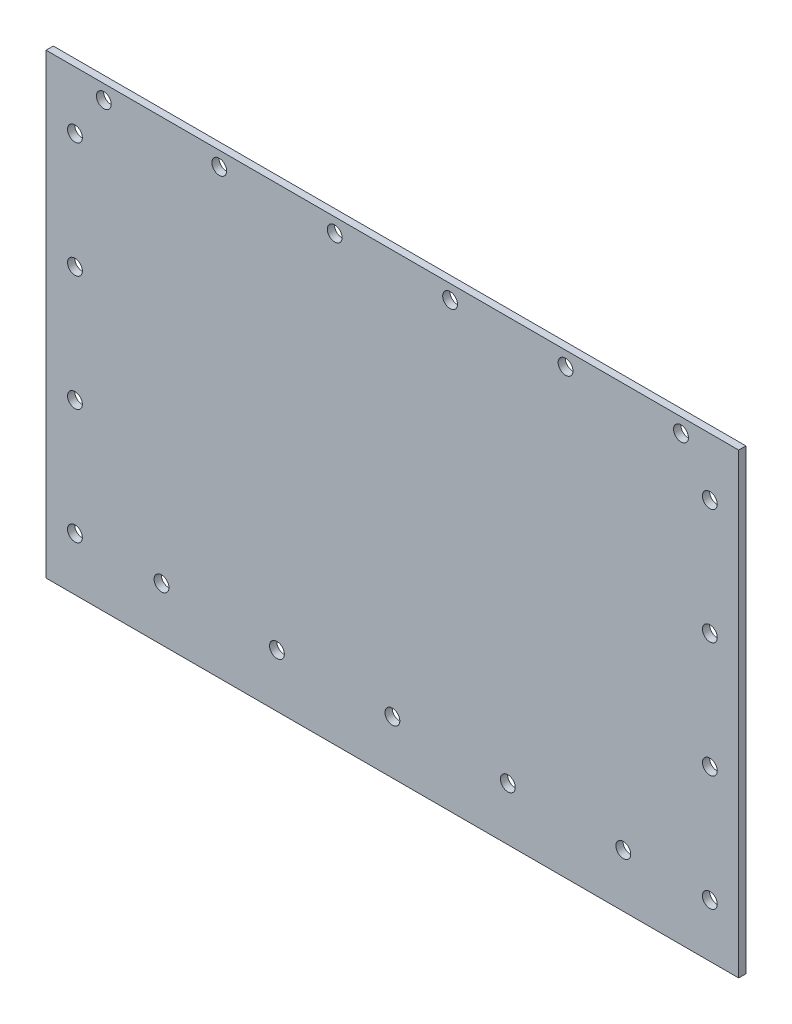
ISO-10303-21;
HEADER;
FILE_DESCRIPTION(('STEP AP214'),'2;1');
FILE_NAME('part.step','',(''),(''),'','','');
FILE_SCHEMA(('AUTOMOTIVE_DESIGN { 1 0 10303 214 1 1 1 1 }'));
ENDSEC;
DATA;
#1=APPLICATION_CONTEXT('core data for automotive mechanical design processes');
#2=APPLICATION_PROTOCOL_DEFINITION('international standard','automotive_design',2000,#1);
#3=PRODUCT_CONTEXT('',#1,'mechanical');
#4=PRODUCT('Part','Part','',(#3));
#5=PRODUCT_RELATED_PRODUCT_CATEGORY('part','',(#4));
#6=PRODUCT_DEFINITION_FORMATION('','',#4);
#7=PRODUCT_DEFINITION_CONTEXT('part definition',#1,'design');
#8=PRODUCT_DEFINITION('design','',#6,#7);
#9=PRODUCT_DEFINITION_SHAPE('','',#8);
#10=(LENGTH_UNIT() NAMED_UNIT(*) SI_UNIT(.MILLI.,.METRE.));
#11=(NAMED_UNIT(*) PLANE_ANGLE_UNIT() SI_UNIT($,.RADIAN.));
#12=(NAMED_UNIT(*) SI_UNIT($,.STERADIAN.) SOLID_ANGLE_UNIT());
#13=UNCERTAINTY_MEASURE_WITH_UNIT(LENGTH_MEASURE(1.E-05),#10,'distance_accuracy_value','');
#14=(GEOMETRIC_REPRESENTATION_CONTEXT(3) GLOBAL_UNCERTAINTY_ASSIGNED_CONTEXT((#13)) GLOBAL_UNIT_ASSIGNED_CONTEXT((#10,
#11,#12)) REPRESENTATION_CONTEXT('',''));
#15=CARTESIAN_POINT('',(0.,0.,0.));
#16=DIRECTION('',(0.,0.,1.));
#17=DIRECTION('',(1.,0.,0.));
#18=AXIS2_PLACEMENT_3D('',#15,#16,#17);
#19=CARTESIAN_POINT('',(152.4,0.,1.5875));
#20=DIRECTION('',(1.,0.,0.));
#21=DIRECTION('',(0.,0.,-1.));
#22=AXIS2_PLACEMENT_3D('',#19,#20,#21);
#23=PLANE('',#22);
#24=DIRECTION('',(0.,-1.,0.));
#25=VECTOR('',#24,1.);
#26=CARTESIAN_POINT('',(152.4,0.,0.));
#27=LINE('',#26,#25);
#28=CARTESIAN_POINT('',(152.4,0.,0.));
#29=VERTEX_POINT('',#28);
#30=CARTESIAN_POINT('',(152.4,-100.6,0.));
#31=VERTEX_POINT('',#30);
#32=EDGE_CURVE('E164',#29,#31,#27,.T.);
#33=ORIENTED_EDGE('',*,*,#32,.F.);
#34=DIRECTION('',(0.,0.,-1.));
#35=VECTOR('',#34,1.);
#36=CARTESIAN_POINT('',(152.4,0.,1.5875));
#37=LINE('',#36,#35);
#38=CARTESIAN_POINT('',(152.4,0.,1.5875));
#39=VERTEX_POINT('',#38);
#40=EDGE_CURVE('E11',#39,#29,#37,.T.);
#41=ORIENTED_EDGE('',*,*,#40,.F.);
#42=DIRECTION('',(0.,-1.,0.));
#43=VECTOR('',#42,1.);
#44=CARTESIAN_POINT('',(152.4,0.,1.5875));
#45=LINE('',#44,#43);
#46=CARTESIAN_POINT('',(152.4,-100.6,1.5875));
#47=VERTEX_POINT('',#46);
#48=EDGE_CURVE('E100',#39,#47,#45,.T.);
#49=ORIENTED_EDGE('',*,*,#48,.T.);
#50=DIRECTION('',(0.,0.,-1.));
#51=VECTOR('',#50,1.);
#52=CARTESIAN_POINT('',(152.4,-100.6,1.5875));
#53=LINE('',#52,#51);
#54=EDGE_CURVE('E79',#47,#31,#53,.T.);
#55=ORIENTED_EDGE('',*,*,#54,.T.);
#56=EDGE_LOOP('',(#33,#41,#49,#55));
#57=FACE_BOUND('',#56,.T.);
#58=ADVANCED_FACE('F39',(#57),#23,.T.);
#59=CARTESIAN_POINT('',(0.,0.,1.5875));
#60=DIRECTION('',(0.,1.,0.));
#61=DIRECTION('',(0.,0.,1.));
#62=AXIS2_PLACEMENT_3D('',#59,#60,#61);
#63=PLANE('',#62);
#64=DIRECTION('',(1.,0.,0.));
#65=VECTOR('',#64,1.);
#66=CARTESIAN_POINT('',(0.,0.,0.));
#67=LINE('',#66,#65);
#68=CARTESIAN_POINT('',(0.,0.,0.));
#69=VERTEX_POINT('',#68);
#70=EDGE_CURVE('E91',#69,#29,#67,.T.);
#71=ORIENTED_EDGE('',*,*,#70,.F.);
#72=DIRECTION('',(0.,0.,-1.));
#73=VECTOR('',#72,1.);
#74=CARTESIAN_POINT('',(0.,0.,1.5875));
#75=LINE('',#74,#73);
#76=CARTESIAN_POINT('',(0.,0.,1.5875));
#77=VERTEX_POINT('',#76);
#78=EDGE_CURVE('E48',#77,#69,#75,.T.);
#79=ORIENTED_EDGE('',*,*,#78,.F.);
#80=DIRECTION('',(1.,0.,0.));
#81=VECTOR('',#80,1.);
#82=CARTESIAN_POINT('',(0.,0.,1.5875));
#83=LINE('',#82,#81);
#84=EDGE_CURVE('E89',#77,#39,#83,.T.);
#85=ORIENTED_EDGE('',*,*,#84,.T.);
#86=ORIENTED_EDGE('',*,*,#40,.T.);
#87=EDGE_LOOP('',(#71,#79,#85,#86));
#88=FACE_BOUND('',#87,.T.);
#89=ADVANCED_FACE('F87',(#88),#63,.T.);
#90=CARTESIAN_POINT('',(0.,0.,1.5875));
#91=DIRECTION('',(1.,0.,0.));
#92=DIRECTION('',(0.,0.,-1.));
#93=AXIS2_PLACEMENT_3D('',#90,#91,#92);
#94=PLANE('',#93);
#95=DIRECTION('',(0.,-1.,0.));
#96=VECTOR('',#95,1.);
#97=CARTESIAN_POINT('',(0.,0.,0.));
#98=LINE('',#97,#96);
#99=CARTESIAN_POINT('',(0.,-100.6,0.));
#100=VERTEX_POINT('',#99);
#101=EDGE_CURVE('E167',#69,#100,#98,.T.);
#102=ORIENTED_EDGE('',*,*,#101,.T.);
#103=DIRECTION('',(0.,0.,-1.));
#104=VECTOR('',#103,1.);
#105=CARTESIAN_POINT('',(0.,-100.6,1.5875));
#106=LINE('',#105,#104);
#107=CARTESIAN_POINT('',(0.,-100.6,1.5875));
#108=VERTEX_POINT('',#107);
#109=EDGE_CURVE('E94',#108,#100,#106,.T.);
#110=ORIENTED_EDGE('',*,*,#109,.F.);
#111=DIRECTION('',(0.,-1.,0.));
#112=VECTOR('',#111,1.);
#113=CARTESIAN_POINT('',(0.,0.,1.5875));
#114=LINE('',#113,#112);
#115=EDGE_CURVE('E96',#77,#108,#114,.T.);
#116=ORIENTED_EDGE('',*,*,#115,.F.);
#117=ORIENTED_EDGE('',*,*,#78,.T.);
#118=EDGE_LOOP('',(#102,#110,#116,#117));
#119=FACE_BOUND('',#118,.T.);
#120=ADVANCED_FACE('F97',(#119),#94,.F.);
#121=CARTESIAN_POINT('',(6.34999999999999,-12.7,1.5875));
#122=DIRECTION('',(0.,0.,-1.));
#123=DIRECTION('',(-1.,0.,0.));
#124=AXIS2_PLACEMENT_3D('',#121,#122,#123);
#125=CYLINDRICAL_SURFACE('',#124,1.63195);
#126=CARTESIAN_POINT('',(6.34999999999999,-12.7,1.5875));
#127=DIRECTION('',(0.,0.,1.));
#128=DIRECTION('',(1.,0.,0.));
#129=AXIS2_PLACEMENT_3D('',#126,#127,#128);
#130=CIRCLE('',#129,1.63195);
#131=CARTESIAN_POINT('',(7.98194999999999,-12.7,1.5875));
#132=VERTEX_POINT('',#131);
#133=EDGE_CURVE('E102',#132,#132,#130,.T.);
#134=ORIENTED_EDGE('',*,*,#133,.T.);
#135=EDGE_LOOP('',(#134));
#136=FACE_BOUND('',#135,.T.);
#137=CARTESIAN_POINT('',(6.34999999999999,-12.7,0.));
#138=DIRECTION('',(0.,0.,1.));
#139=DIRECTION('',(1.,0.,0.));
#140=AXIS2_PLACEMENT_3D('',#137,#138,#139);
#141=CIRCLE('',#140,1.63195);
#142=CARTESIAN_POINT('',(7.98194999999999,-12.7,0.));
#143=VERTEX_POINT('',#142);
#144=EDGE_CURVE('E161',#143,#143,#141,.T.);
#145=ORIENTED_EDGE('',*,*,#144,.F.);
#146=EDGE_LOOP('',(#145));
#147=FACE_BOUND('',#146,.T.);
#148=ADVANCED_FACE('F183',(#136,#147),#125,.F.);
#149=CARTESIAN_POINT('',(146.05,-12.7,1.5875));
#150=DIRECTION('',(0.,0.,-1.));
#151=DIRECTION('',(-1.,0.,0.));
#152=AXIS2_PLACEMENT_3D('',#149,#150,#151);
#153=CYLINDRICAL_SURFACE('',#152,1.63195);
#154=CARTESIAN_POINT('',(146.05,-12.7,1.5875));
#155=DIRECTION('',(0.,0.,1.));
#156=DIRECTION('',(1.,0.,0.));
#157=AXIS2_PLACEMENT_3D('',#154,#155,#156);
#158=CIRCLE('',#157,1.63195);
#159=CARTESIAN_POINT('',(147.68195,-12.7,1.5875));
#160=VERTEX_POINT('',#159);
#161=EDGE_CURVE('E538',#160,#160,#158,.T.);
#162=ORIENTED_EDGE('',*,*,#161,.T.);
#163=EDGE_LOOP('',(#162));
#164=FACE_BOUND('',#163,.T.);
#165=CARTESIAN_POINT('',(146.05,-12.7,0.));
#166=DIRECTION('',(0.,0.,1.));
#167=DIRECTION('',(1.,0.,0.));
#168=AXIS2_PLACEMENT_3D('',#165,#166,#167);
#169=CIRCLE('',#168,1.63195);
#170=CARTESIAN_POINT('',(147.68195,-12.7,0.));
#171=VERTEX_POINT('',#170);
#172=EDGE_CURVE('E158',#171,#171,#169,.T.);
#173=ORIENTED_EDGE('',*,*,#172,.F.);
#174=EDGE_LOOP('',(#173));
#175=FACE_BOUND('',#174,.T.);
#176=ADVANCED_FACE('F186',(#164,#175),#153,.F.);
#177=CARTESIAN_POINT('',(146.05,-38.1,1.5875));
#178=DIRECTION('',(0.,0.,-1.));
#179=DIRECTION('',(-1.,0.,0.));
#180=AXIS2_PLACEMENT_3D('',#177,#178,#179);
#181=CYLINDRICAL_SURFACE('',#180,1.63195);
#182=CARTESIAN_POINT('',(146.05,-38.1,1.5875));
#183=DIRECTION('',(0.,0.,1.));
#184=DIRECTION('',(1.,0.,0.));
#185=AXIS2_PLACEMENT_3D('',#182,#183,#184);
#186=CIRCLE('',#185,1.63195);
#187=CARTESIAN_POINT('',(147.68195,-38.1,1.5875));
#188=VERTEX_POINT('',#187);
#189=EDGE_CURVE('E534',#188,#188,#186,.T.);
#190=ORIENTED_EDGE('',*,*,#189,.T.);
#191=EDGE_LOOP('',(#190));
#192=FACE_BOUND('',#191,.T.);
#193=CARTESIAN_POINT('',(146.05,-38.1,0.));
#194=DIRECTION('',(0.,0.,1.));
#195=DIRECTION('',(1.,0.,0.));
#196=AXIS2_PLACEMENT_3D('',#193,#194,#195);
#197=CIRCLE('',#196,1.63195);
#198=CARTESIAN_POINT('',(147.68195,-38.1,0.));
#199=VERTEX_POINT('',#198);
#200=EDGE_CURVE('E155',#199,#199,#197,.T.);
#201=ORIENTED_EDGE('',*,*,#200,.F.);
#202=EDGE_LOOP('',(#201));
#203=FACE_BOUND('',#202,.T.);
#204=ADVANCED_FACE('F190',(#192,#203),#181,.F.);
#205=CARTESIAN_POINT('',(146.05,-63.5,1.5875));
#206=DIRECTION('',(0.,0.,-1.));
#207=DIRECTION('',(-1.,0.,0.));
#208=AXIS2_PLACEMENT_3D('',#205,#206,#207);
#209=CYLINDRICAL_SURFACE('',#208,1.63195);
#210=CARTESIAN_POINT('',(146.05,-63.5,1.5875));
#211=DIRECTION('',(0.,0.,1.));
#212=DIRECTION('',(1.,0.,0.));
#213=AXIS2_PLACEMENT_3D('',#210,#211,#212);
#214=CIRCLE('',#213,1.63195);
#215=CARTESIAN_POINT('',(147.68195,-63.5,1.5875));
#216=VERTEX_POINT('',#215);
#217=EDGE_CURVE('E530',#216,#216,#214,.T.);
#218=ORIENTED_EDGE('',*,*,#217,.T.);
#219=EDGE_LOOP('',(#218));
#220=FACE_BOUND('',#219,.T.);
#221=CARTESIAN_POINT('',(146.05,-63.5,0.));
#222=DIRECTION('',(0.,0.,1.));
#223=DIRECTION('',(1.,0.,0.));
#224=AXIS2_PLACEMENT_3D('',#221,#222,#223);
#225=CIRCLE('',#224,1.63195);
#226=CARTESIAN_POINT('',(147.68195,-63.5,0.));
#227=VERTEX_POINT('',#226);
#228=EDGE_CURVE('E152',#227,#227,#225,.T.);
#229=ORIENTED_EDGE('',*,*,#228,.F.);
#230=EDGE_LOOP('',(#229));
#231=FACE_BOUND('',#230,.T.);
#232=ADVANCED_FACE('F194',(#220,#231),#209,.F.);
#233=CARTESIAN_POINT('',(146.05,-88.9,1.5875));
#234=DIRECTION('',(0.,0.,-1.));
#235=DIRECTION('',(-1.,0.,0.));
#236=AXIS2_PLACEMENT_3D('',#233,#234,#235);
#237=CYLINDRICAL_SURFACE('',#236,1.63195);
#238=CARTESIAN_POINT('',(146.05,-88.9,1.5875));
#239=DIRECTION('',(0.,0.,1.));
#240=DIRECTION('',(1.,0.,0.));
#241=AXIS2_PLACEMENT_3D('',#238,#239,#240);
#242=CIRCLE('',#241,1.63195);
#243=CARTESIAN_POINT('',(147.68195,-88.9,1.5875));
#244=VERTEX_POINT('',#243);
#245=EDGE_CURVE('E526',#244,#244,#242,.T.);
#246=ORIENTED_EDGE('',*,*,#245,.T.);
#247=EDGE_LOOP('',(#246));
#248=FACE_BOUND('',#247,.T.);
#249=CARTESIAN_POINT('',(146.05,-88.9,0.));
#250=DIRECTION('',(0.,0.,1.));
#251=DIRECTION('',(1.,0.,0.));
#252=AXIS2_PLACEMENT_3D('',#249,#250,#251);
#253=CIRCLE('',#252,1.63195);
#254=CARTESIAN_POINT('',(147.68195,-88.9,0.));
#255=VERTEX_POINT('',#254);
#256=EDGE_CURVE('E149',#255,#255,#253,.T.);
#257=ORIENTED_EDGE('',*,*,#256,.F.);
#258=EDGE_LOOP('',(#257));
#259=FACE_BOUND('',#258,.T.);
#260=ADVANCED_FACE('F198',(#248,#259),#237,.F.);
#261=CARTESIAN_POINT('',(6.35,-38.1,1.5875));
#262=DIRECTION('',(0.,0.,-1.));
#263=DIRECTION('',(-1.,0.,0.));
#264=AXIS2_PLACEMENT_3D('',#261,#262,#263);
#265=CYLINDRICAL_SURFACE('',#264,1.63195);
#266=CARTESIAN_POINT('',(6.35,-38.1,1.5875));
#267=DIRECTION('',(0.,0.,1.));
#268=DIRECTION('',(1.,0.,0.));
#269=AXIS2_PLACEMENT_3D('',#266,#267,#268);
#270=CIRCLE('',#269,1.63195);
#271=CARTESIAN_POINT('',(7.98195,-38.1,1.5875));
#272=VERTEX_POINT('',#271);
#273=EDGE_CURVE('E522',#272,#272,#270,.T.);
#274=ORIENTED_EDGE('',*,*,#273,.T.);
#275=EDGE_LOOP('',(#274));
#276=FACE_BOUND('',#275,.T.);
#277=CARTESIAN_POINT('',(6.35,-38.1,0.));
#278=DIRECTION('',(0.,0.,1.));
#279=DIRECTION('',(1.,0.,0.));
#280=AXIS2_PLACEMENT_3D('',#277,#278,#279);
#281=CIRCLE('',#280,1.63195);
#282=CARTESIAN_POINT('',(7.98195,-38.1,0.));
#283=VERTEX_POINT('',#282);
#284=EDGE_CURVE('E146',#283,#283,#281,.T.);
#285=ORIENTED_EDGE('',*,*,#284,.F.);
#286=EDGE_LOOP('',(#285));
#287=FACE_BOUND('',#286,.T.);
#288=ADVANCED_FACE('F202',(#276,#287),#265,.F.);
#289=CARTESIAN_POINT('',(6.35,-63.5,1.5875));
#290=DIRECTION('',(0.,0.,-1.));
#291=DIRECTION('',(-1.,0.,0.));
#292=AXIS2_PLACEMENT_3D('',#289,#290,#291);
#293=CYLINDRICAL_SURFACE('',#292,1.63195);
#294=CARTESIAN_POINT('',(6.35,-63.5,1.5875));
#295=DIRECTION('',(0.,0.,1.));
#296=DIRECTION('',(1.,0.,0.));
#297=AXIS2_PLACEMENT_3D('',#294,#295,#296);
#298=CIRCLE('',#297,1.63195);
#299=CARTESIAN_POINT('',(7.98195,-63.5,1.5875));
#300=VERTEX_POINT('',#299);
#301=EDGE_CURVE('E518',#300,#300,#298,.T.);
#302=ORIENTED_EDGE('',*,*,#301,.T.);
#303=EDGE_LOOP('',(#302));
#304=FACE_BOUND('',#303,.T.);
#305=CARTESIAN_POINT('',(6.35,-63.5,0.));
#306=DIRECTION('',(0.,0.,1.));
#307=DIRECTION('',(1.,0.,0.));
#308=AXIS2_PLACEMENT_3D('',#305,#306,#307);
#309=CIRCLE('',#308,1.63195);
#310=CARTESIAN_POINT('',(7.98195,-63.5,0.));
#311=VERTEX_POINT('',#310);
#312=EDGE_CURVE('E143',#311,#311,#309,.T.);
#313=ORIENTED_EDGE('',*,*,#312,.F.);
#314=EDGE_LOOP('',(#313));
#315=FACE_BOUND('',#314,.T.);
#316=ADVANCED_FACE('F206',(#304,#315),#293,.F.);
#317=CARTESIAN_POINT('',(6.35,-88.9,1.5875));
#318=DIRECTION('',(0.,0.,-1.));
#319=DIRECTION('',(-1.,0.,0.));
#320=AXIS2_PLACEMENT_3D('',#317,#318,#319);
#321=CYLINDRICAL_SURFACE('',#320,1.63195);
#322=CARTESIAN_POINT('',(6.35,-88.9,1.5875));
#323=DIRECTION('',(0.,0.,1.));
#324=DIRECTION('',(1.,0.,0.));
#325=AXIS2_PLACEMENT_3D('',#322,#323,#324);
#326=CIRCLE('',#325,1.63195);
#327=CARTESIAN_POINT('',(7.98195,-88.9,1.5875));
#328=VERTEX_POINT('',#327);
#329=EDGE_CURVE('E514',#328,#328,#326,.T.);
#330=ORIENTED_EDGE('',*,*,#329,.T.);
#331=EDGE_LOOP('',(#330));
#332=FACE_BOUND('',#331,.T.);
#333=CARTESIAN_POINT('',(6.35,-88.9,0.));
#334=DIRECTION('',(0.,0.,1.));
#335=DIRECTION('',(1.,0.,0.));
#336=AXIS2_PLACEMENT_3D('',#333,#334,#335);
#337=CIRCLE('',#336,1.63195);
#338=CARTESIAN_POINT('',(7.98195,-88.9,0.));
#339=VERTEX_POINT('',#338);
#340=EDGE_CURVE('E140',#339,#339,#337,.T.);
#341=ORIENTED_EDGE('',*,*,#340,.F.);
#342=EDGE_LOOP('',(#341));
#343=FACE_BOUND('',#342,.T.);
#344=ADVANCED_FACE('F210',(#332,#343),#321,.F.);
#345=CARTESIAN_POINT('',(12.7,-3.175,1.5875));
#346=DIRECTION('',(0.,0.,-1.));
#347=DIRECTION('',(-1.,0.,0.));
#348=AXIS2_PLACEMENT_3D('',#345,#346,#347);
#349=CYLINDRICAL_SURFACE('',#348,1.63195);
#350=CARTESIAN_POINT('',(12.7,-3.175,1.5875));
#351=DIRECTION('',(0.,0.,1.));
#352=DIRECTION('',(1.,0.,0.));
#353=AXIS2_PLACEMENT_3D('',#350,#351,#352);
#354=CIRCLE('',#353,1.63195);
#355=CARTESIAN_POINT('',(14.33195,-3.175,1.5875));
#356=VERTEX_POINT('',#355);
#357=EDGE_CURVE('E510',#356,#356,#354,.T.);
#358=ORIENTED_EDGE('',*,*,#357,.T.);
#359=EDGE_LOOP('',(#358));
#360=FACE_BOUND('',#359,.T.);
#361=CARTESIAN_POINT('',(12.7,-3.175,0.));
#362=DIRECTION('',(0.,0.,1.));
#363=DIRECTION('',(1.,0.,0.));
#364=AXIS2_PLACEMENT_3D('',#361,#362,#363);
#365=CIRCLE('',#364,1.63195);
#366=CARTESIAN_POINT('',(14.33195,-3.175,0.));
#367=VERTEX_POINT('',#366);
#368=EDGE_CURVE('E137',#367,#367,#365,.T.);
#369=ORIENTED_EDGE('',*,*,#368,.F.);
#370=EDGE_LOOP('',(#369));
#371=FACE_BOUND('',#370,.T.);
#372=ADVANCED_FACE('F214',(#360,#371),#349,.F.);
#373=CARTESIAN_POINT('',(38.1,-3.175,1.5875));
#374=DIRECTION('',(0.,0.,-1.));
#375=DIRECTION('',(-1.,0.,0.));
#376=AXIS2_PLACEMENT_3D('',#373,#374,#375);
#377=CYLINDRICAL_SURFACE('',#376,1.63195);
#378=CARTESIAN_POINT('',(38.1,-3.175,1.5875));
#379=DIRECTION('',(0.,0.,1.));
#380=DIRECTION('',(1.,0.,0.));
#381=AXIS2_PLACEMENT_3D('',#378,#379,#380);
#382=CIRCLE('',#381,1.63195);
#383=CARTESIAN_POINT('',(39.73195,-3.175,1.5875));
#384=VERTEX_POINT('',#383);
#385=EDGE_CURVE('E506',#384,#384,#382,.T.);
#386=ORIENTED_EDGE('',*,*,#385,.T.);
#387=EDGE_LOOP('',(#386));
#388=FACE_BOUND('',#387,.T.);
#389=CARTESIAN_POINT('',(38.1,-3.175,0.));
#390=DIRECTION('',(0.,0.,1.));
#391=DIRECTION('',(1.,0.,0.));
#392=AXIS2_PLACEMENT_3D('',#389,#390,#391);
#393=CIRCLE('',#392,1.63195);
#394=CARTESIAN_POINT('',(39.73195,-3.175,0.));
#395=VERTEX_POINT('',#394);
#396=EDGE_CURVE('E134',#395,#395,#393,.T.);
#397=ORIENTED_EDGE('',*,*,#396,.F.);
#398=EDGE_LOOP('',(#397));
#399=FACE_BOUND('',#398,.T.);
#400=ADVANCED_FACE('F218',(#388,#399),#377,.F.);
#401=CARTESIAN_POINT('',(63.5,-3.175,1.5875));
#402=DIRECTION('',(0.,0.,-1.));
#403=DIRECTION('',(-1.,0.,0.));
#404=AXIS2_PLACEMENT_3D('',#401,#402,#403);
#405=CYLINDRICAL_SURFACE('',#404,1.63195);
#406=CARTESIAN_POINT('',(63.5,-3.175,1.5875));
#407=DIRECTION('',(0.,0.,1.));
#408=DIRECTION('',(1.,0.,0.));
#409=AXIS2_PLACEMENT_3D('',#406,#407,#408);
#410=CIRCLE('',#409,1.63195);
#411=CARTESIAN_POINT('',(65.13195,-3.175,1.5875));
#412=VERTEX_POINT('',#411);
#413=EDGE_CURVE('E502',#412,#412,#410,.T.);
#414=ORIENTED_EDGE('',*,*,#413,.T.);
#415=EDGE_LOOP('',(#414));
#416=FACE_BOUND('',#415,.T.);
#417=CARTESIAN_POINT('',(63.5,-3.175,0.));
#418=DIRECTION('',(0.,0.,1.));
#419=DIRECTION('',(1.,0.,0.));
#420=AXIS2_PLACEMENT_3D('',#417,#418,#419);
#421=CIRCLE('',#420,1.63195);
#422=CARTESIAN_POINT('',(65.13195,-3.175,0.));
#423=VERTEX_POINT('',#422);
#424=EDGE_CURVE('E131',#423,#423,#421,.T.);
#425=ORIENTED_EDGE('',*,*,#424,.F.);
#426=EDGE_LOOP('',(#425));
#427=FACE_BOUND('',#426,.T.);
#428=ADVANCED_FACE('F222',(#416,#427),#405,.F.);
#429=CARTESIAN_POINT('',(88.9,-3.175,1.5875));
#430=DIRECTION('',(0.,0.,-1.));
#431=DIRECTION('',(-1.,0.,0.));
#432=AXIS2_PLACEMENT_3D('',#429,#430,#431);
#433=CYLINDRICAL_SURFACE('',#432,1.63195);
#434=CARTESIAN_POINT('',(88.9,-3.175,1.5875));
#435=DIRECTION('',(0.,0.,1.));
#436=DIRECTION('',(1.,0.,0.));
#437=AXIS2_PLACEMENT_3D('',#434,#435,#436);
#438=CIRCLE('',#437,1.63195);
#439=CARTESIAN_POINT('',(90.53195,-3.175,1.5875));
#440=VERTEX_POINT('',#439);
#441=EDGE_CURVE('E498',#440,#440,#438,.T.);
#442=ORIENTED_EDGE('',*,*,#441,.T.);
#443=EDGE_LOOP('',(#442));
#444=FACE_BOUND('',#443,.T.);
#445=CARTESIAN_POINT('',(88.9,-3.175,0.));
#446=DIRECTION('',(0.,0.,1.));
#447=DIRECTION('',(1.,0.,0.));
#448=AXIS2_PLACEMENT_3D('',#445,#446,#447);
#449=CIRCLE('',#448,1.63195);
#450=CARTESIAN_POINT('',(90.53195,-3.175,0.));
#451=VERTEX_POINT('',#450);
#452=EDGE_CURVE('E128',#451,#451,#449,.T.);
#453=ORIENTED_EDGE('',*,*,#452,.F.);
#454=EDGE_LOOP('',(#453));
#455=FACE_BOUND('',#454,.T.);
#456=ADVANCED_FACE('F226',(#444,#455),#433,.F.);
#457=CARTESIAN_POINT('',(114.3,-3.175,1.5875));
#458=DIRECTION('',(0.,0.,-1.));
#459=DIRECTION('',(-1.,0.,0.));
#460=AXIS2_PLACEMENT_3D('',#457,#458,#459);
#461=CYLINDRICAL_SURFACE('',#460,1.63195);
#462=CARTESIAN_POINT('',(114.3,-3.175,1.5875));
#463=DIRECTION('',(0.,0.,1.));
#464=DIRECTION('',(1.,0.,0.));
#465=AXIS2_PLACEMENT_3D('',#462,#463,#464);
#466=CIRCLE('',#465,1.63195);
#467=CARTESIAN_POINT('',(115.93195,-3.175,1.5875));
#468=VERTEX_POINT('',#467);
#469=EDGE_CURVE('E494',#468,#468,#466,.T.);
#470=ORIENTED_EDGE('',*,*,#469,.T.);
#471=EDGE_LOOP('',(#470));
#472=FACE_BOUND('',#471,.T.);
#473=CARTESIAN_POINT('',(114.3,-3.175,0.));
#474=DIRECTION('',(0.,0.,1.));
#475=DIRECTION('',(1.,0.,0.));
#476=AXIS2_PLACEMENT_3D('',#473,#474,#475);
#477=CIRCLE('',#476,1.63195);
#478=CARTESIAN_POINT('',(115.93195,-3.175,0.));
#479=VERTEX_POINT('',#478);
#480=EDGE_CURVE('E125',#479,#479,#477,.T.);
#481=ORIENTED_EDGE('',*,*,#480,.F.);
#482=EDGE_LOOP('',(#481));
#483=FACE_BOUND('',#482,.T.);
#484=ADVANCED_FACE('F230',(#472,#483),#461,.F.);
#485=CARTESIAN_POINT('',(139.7,-3.175,1.5875));
#486=DIRECTION('',(0.,0.,-1.));
#487=DIRECTION('',(-1.,0.,0.));
#488=AXIS2_PLACEMENT_3D('',#485,#486,#487);
#489=CYLINDRICAL_SURFACE('',#488,1.63195);
#490=CARTESIAN_POINT('',(139.7,-3.175,1.5875));
#491=DIRECTION('',(0.,0.,1.));
#492=DIRECTION('',(1.,0.,0.));
#493=AXIS2_PLACEMENT_3D('',#490,#491,#492);
#494=CIRCLE('',#493,1.63195);
#495=CARTESIAN_POINT('',(141.33195,-3.175,1.5875));
#496=VERTEX_POINT('',#495);
#497=EDGE_CURVE('E490',#496,#496,#494,.T.);
#498=ORIENTED_EDGE('',*,*,#497,.T.);
#499=EDGE_LOOP('',(#498));
#500=FACE_BOUND('',#499,.T.);
#501=CARTESIAN_POINT('',(139.7,-3.175,0.));
#502=DIRECTION('',(0.,0.,1.));
#503=DIRECTION('',(1.,0.,0.));
#504=AXIS2_PLACEMENT_3D('',#501,#502,#503);
#505=CIRCLE('',#504,1.63195);
#506=CARTESIAN_POINT('',(141.33195,-3.175,0.));
#507=VERTEX_POINT('',#506);
#508=EDGE_CURVE('E122',#507,#507,#505,.T.);
#509=ORIENTED_EDGE('',*,*,#508,.F.);
#510=EDGE_LOOP('',(#509));
#511=FACE_BOUND('',#510,.T.);
#512=ADVANCED_FACE('F234',(#500,#511),#489,.F.);
#513=CARTESIAN_POINT('',(25.4,-88.9,1.5875));
#514=DIRECTION('',(0.,0.,-1.));
#515=DIRECTION('',(-1.,0.,0.));
#516=AXIS2_PLACEMENT_3D('',#513,#514,#515);
#517=CYLINDRICAL_SURFACE('',#516,1.63195);
#518=CARTESIAN_POINT('',(25.4,-88.9,1.5875));
#519=DIRECTION('',(0.,0.,1.));
#520=DIRECTION('',(1.,0.,0.));
#521=AXIS2_PLACEMENT_3D('',#518,#519,#520);
#522=CIRCLE('',#521,1.63195);
#523=CARTESIAN_POINT('',(27.03195,-88.9,1.5875));
#524=VERTEX_POINT('',#523);
#525=EDGE_CURVE('E486',#524,#524,#522,.T.);
#526=ORIENTED_EDGE('',*,*,#525,.T.);
#527=EDGE_LOOP('',(#526));
#528=FACE_BOUND('',#527,.T.);
#529=CARTESIAN_POINT('',(25.4,-88.9,0.));
#530=DIRECTION('',(0.,0.,1.));
#531=DIRECTION('',(1.,0.,0.));
#532=AXIS2_PLACEMENT_3D('',#529,#530,#531);
#533=CIRCLE('',#532,1.63195);
#534=CARTESIAN_POINT('',(27.03195,-88.9,0.));
#535=VERTEX_POINT('',#534);
#536=EDGE_CURVE('E119',#535,#535,#533,.T.);
#537=ORIENTED_EDGE('',*,*,#536,.F.);
#538=EDGE_LOOP('',(#537));
#539=FACE_BOUND('',#538,.T.);
#540=ADVANCED_FACE('F238',(#528,#539),#517,.F.);
#541=CARTESIAN_POINT('',(50.8,-88.9,1.5875));
#542=DIRECTION('',(0.,0.,-1.));
#543=DIRECTION('',(-1.,0.,0.));
#544=AXIS2_PLACEMENT_3D('',#541,#542,#543);
#545=CYLINDRICAL_SURFACE('',#544,1.63194999999999);
#546=CARTESIAN_POINT('',(50.8,-88.9,1.5875));
#547=DIRECTION('',(0.,0.,1.));
#548=DIRECTION('',(1.,0.,0.));
#549=AXIS2_PLACEMENT_3D('',#546,#547,#548);
#550=CIRCLE('',#549,1.63194999999999);
#551=CARTESIAN_POINT('',(52.43195,-88.9,1.5875));
#552=VERTEX_POINT('',#551);
#553=EDGE_CURVE('E482',#552,#552,#550,.T.);
#554=ORIENTED_EDGE('',*,*,#553,.T.);
#555=EDGE_LOOP('',(#554));
#556=FACE_BOUND('',#555,.T.);
#557=CARTESIAN_POINT('',(50.8,-88.9,0.));
#558=DIRECTION('',(0.,0.,1.));
#559=DIRECTION('',(1.,0.,0.));
#560=AXIS2_PLACEMENT_3D('',#557,#558,#559);
#561=CIRCLE('',#560,1.63194999999999);
#562=CARTESIAN_POINT('',(52.43195,-88.9,0.));
#563=VERTEX_POINT('',#562);
#564=EDGE_CURVE('E116',#563,#563,#561,.T.);
#565=ORIENTED_EDGE('',*,*,#564,.F.);
#566=EDGE_LOOP('',(#565));
#567=FACE_BOUND('',#566,.T.);
#568=ADVANCED_FACE('F242',(#556,#567),#545,.F.);
#569=CARTESIAN_POINT('',(76.2,-88.9,1.5875));
#570=DIRECTION('',(0.,0.,-1.));
#571=DIRECTION('',(-1.,0.,0.));
#572=AXIS2_PLACEMENT_3D('',#569,#570,#571);
#573=CYLINDRICAL_SURFACE('',#572,1.63195);
#574=CARTESIAN_POINT('',(76.2,-88.9,1.5875));
#575=DIRECTION('',(0.,0.,1.));
#576=DIRECTION('',(1.,0.,0.));
#577=AXIS2_PLACEMENT_3D('',#574,#575,#576);
#578=CIRCLE('',#577,1.63195);
#579=CARTESIAN_POINT('',(77.83195,-88.9,1.5875));
#580=VERTEX_POINT('',#579);
#581=EDGE_CURVE('E478',#580,#580,#578,.T.);
#582=ORIENTED_EDGE('',*,*,#581,.T.);
#583=EDGE_LOOP('',(#582));
#584=FACE_BOUND('',#583,.T.);
#585=CARTESIAN_POINT('',(76.2,-88.9,0.));
#586=DIRECTION('',(0.,0.,1.));
#587=DIRECTION('',(1.,0.,0.));
#588=AXIS2_PLACEMENT_3D('',#585,#586,#587);
#589=CIRCLE('',#588,1.63195);
#590=CARTESIAN_POINT('',(77.83195,-88.9,0.));
#591=VERTEX_POINT('',#590);
#592=EDGE_CURVE('E113',#591,#591,#589,.T.);
#593=ORIENTED_EDGE('',*,*,#592,.F.);
#594=EDGE_LOOP('',(#593));
#595=FACE_BOUND('',#594,.T.);
#596=ADVANCED_FACE('F246',(#584,#595),#573,.F.);
#597=CARTESIAN_POINT('',(101.6,-88.9,1.5875));
#598=DIRECTION('',(0.,0.,-1.));
#599=DIRECTION('',(-1.,0.,0.));
#600=AXIS2_PLACEMENT_3D('',#597,#598,#599);
#601=CYLINDRICAL_SURFACE('',#600,1.63195);
#602=CARTESIAN_POINT('',(101.6,-88.9,1.5875));
#603=DIRECTION('',(0.,0.,1.));
#604=DIRECTION('',(1.,0.,0.));
#605=AXIS2_PLACEMENT_3D('',#602,#603,#604);
#606=CIRCLE('',#605,1.63195);
#607=CARTESIAN_POINT('',(103.23195,-88.9,1.5875));
#608=VERTEX_POINT('',#607);
#609=EDGE_CURVE('E260',#608,#608,#606,.T.);
#610=ORIENTED_EDGE('',*,*,#609,.T.);
#611=EDGE_LOOP('',(#610));
#612=FACE_BOUND('',#611,.T.);
#613=CARTESIAN_POINT('',(101.6,-88.9,0.));
#614=DIRECTION('',(0.,0.,1.));
#615=DIRECTION('',(1.,0.,0.));
#616=AXIS2_PLACEMENT_3D('',#613,#614,#615);
#617=CIRCLE('',#616,1.63195);
#618=CARTESIAN_POINT('',(103.23195,-88.9,0.));
#619=VERTEX_POINT('',#618);
#620=EDGE_CURVE('E110',#619,#619,#617,.T.);
#621=ORIENTED_EDGE('',*,*,#620,.F.);
#622=EDGE_LOOP('',(#621));
#623=FACE_BOUND('',#622,.T.);
#624=ADVANCED_FACE('F249',(#612,#623),#601,.F.);
#625=CARTESIAN_POINT('',(127.,-88.9,1.5875));
#626=DIRECTION('',(0.,0.,-1.));
#627=DIRECTION('',(-1.,0.,0.));
#628=AXIS2_PLACEMENT_3D('',#625,#626,#627);
#629=CYLINDRICAL_SURFACE('',#628,1.63195);
#630=CARTESIAN_POINT('',(127.,-88.9,1.5875));
#631=DIRECTION('',(0.,0.,1.));
#632=DIRECTION('',(1.,0.,0.));
#633=AXIS2_PLACEMENT_3D('',#630,#631,#632);
#634=CIRCLE('',#633,1.63195);
#635=CARTESIAN_POINT('',(128.63195,-88.9,1.5875));
#636=VERTEX_POINT('',#635);
#637=EDGE_CURVE('E170',#636,#636,#634,.T.);
#638=ORIENTED_EDGE('',*,*,#637,.T.);
#639=EDGE_LOOP('',(#638));
#640=FACE_BOUND('',#639,.T.);
#641=CARTESIAN_POINT('',(127.,-88.9,0.));
#642=DIRECTION('',(0.,0.,1.));
#643=DIRECTION('',(1.,0.,0.));
#644=AXIS2_PLACEMENT_3D('',#641,#642,#643);
#645=CIRCLE('',#644,1.63195);
#646=CARTESIAN_POINT('',(128.63195,-88.9,0.));
#647=VERTEX_POINT('',#646);
#648=EDGE_CURVE('E107',#647,#647,#645,.T.);
#649=ORIENTED_EDGE('',*,*,#648,.F.);
#650=EDGE_LOOP('',(#649));
#651=FACE_BOUND('',#650,.T.);
#652=ADVANCED_FACE('F41',(#640,#651),#629,.F.);
#653=CARTESIAN_POINT('',(0.,-100.6,1.5875));
#654=DIRECTION('',(0.,1.,0.));
#655=DIRECTION('',(0.,0.,1.));
#656=AXIS2_PLACEMENT_3D('',#653,#654,#655);
#657=PLANE('',#656);
#658=DIRECTION('',(1.,0.,0.));
#659=VECTOR('',#658,1.);
#660=CARTESIAN_POINT('',(0.,-100.6,0.));
#661=LINE('',#660,#659);
#662=EDGE_CURVE('E72',#100,#31,#661,.T.);
#663=ORIENTED_EDGE('',*,*,#662,.T.);
#664=ORIENTED_EDGE('',*,*,#54,.F.);
#665=DIRECTION('',(1.,0.,0.));
#666=VECTOR('',#665,1.);
#667=CARTESIAN_POINT('',(0.,-100.6,1.5875));
#668=LINE('',#667,#666);
#669=EDGE_CURVE('E56',#108,#47,#668,.T.);
#670=ORIENTED_EDGE('',*,*,#669,.F.);
#671=ORIENTED_EDGE('',*,*,#109,.T.);
#672=EDGE_LOOP('',(#663,#664,#670,#671));
#673=FACE_BOUND('',#672,.T.);
#674=ADVANCED_FACE('F173',(#673),#657,.F.);
#675=CARTESIAN_POINT('',(0.,0.,1.5875));
#676=DIRECTION('',(0.,0.,1.));
#677=DIRECTION('',(1.,0.,0.));
#678=AXIS2_PLACEMENT_3D('',#675,#676,#677);
#679=PLANE('',#678);
#680=ORIENTED_EDGE('',*,*,#637,.F.);
#681=EDGE_LOOP('',(#680));
#682=FACE_BOUND('',#681,.T.);
#683=ORIENTED_EDGE('',*,*,#609,.F.);
#684=EDGE_LOOP('',(#683));
#685=FACE_BOUND('',#684,.T.);
#686=ORIENTED_EDGE('',*,*,#581,.F.);
#687=EDGE_LOOP('',(#686));
#688=FACE_BOUND('',#687,.T.);
#689=ORIENTED_EDGE('',*,*,#553,.F.);
#690=EDGE_LOOP('',(#689));
#691=FACE_BOUND('',#690,.T.);
#692=ORIENTED_EDGE('',*,*,#525,.F.);
#693=EDGE_LOOP('',(#692));
#694=FACE_BOUND('',#693,.T.);
#695=ORIENTED_EDGE('',*,*,#497,.F.);
#696=EDGE_LOOP('',(#695));
#697=FACE_BOUND('',#696,.T.);
#698=ORIENTED_EDGE('',*,*,#469,.F.);
#699=EDGE_LOOP('',(#698));
#700=FACE_BOUND('',#699,.T.);
#701=ORIENTED_EDGE('',*,*,#441,.F.);
#702=EDGE_LOOP('',(#701));
#703=FACE_BOUND('',#702,.T.);
#704=ORIENTED_EDGE('',*,*,#413,.F.);
#705=EDGE_LOOP('',(#704));
#706=FACE_BOUND('',#705,.T.);
#707=ORIENTED_EDGE('',*,*,#385,.F.);
#708=EDGE_LOOP('',(#707));
#709=FACE_BOUND('',#708,.T.);
#710=ORIENTED_EDGE('',*,*,#357,.F.);
#711=EDGE_LOOP('',(#710));
#712=FACE_BOUND('',#711,.T.);
#713=ORIENTED_EDGE('',*,*,#329,.F.);
#714=EDGE_LOOP('',(#713));
#715=FACE_BOUND('',#714,.T.);
#716=ORIENTED_EDGE('',*,*,#301,.F.);
#717=EDGE_LOOP('',(#716));
#718=FACE_BOUND('',#717,.T.);
#719=ORIENTED_EDGE('',*,*,#273,.F.);
#720=EDGE_LOOP('',(#719));
#721=FACE_BOUND('',#720,.T.);
#722=ORIENTED_EDGE('',*,*,#245,.F.);
#723=EDGE_LOOP('',(#722));
#724=FACE_BOUND('',#723,.T.);
#725=ORIENTED_EDGE('',*,*,#217,.F.);
#726=EDGE_LOOP('',(#725));
#727=FACE_BOUND('',#726,.T.);
#728=ORIENTED_EDGE('',*,*,#189,.F.);
#729=EDGE_LOOP('',(#728));
#730=FACE_BOUND('',#729,.T.);
#731=ORIENTED_EDGE('',*,*,#161,.F.);
#732=EDGE_LOOP('',(#731));
#733=FACE_BOUND('',#732,.T.);
#734=ORIENTED_EDGE('',*,*,#133,.F.);
#735=EDGE_LOOP('',(#734));
#736=FACE_BOUND('',#735,.T.);
#737=ORIENTED_EDGE('',*,*,#48,.F.);
#738=ORIENTED_EDGE('',*,*,#84,.F.);
#739=ORIENTED_EDGE('',*,*,#115,.T.);
#740=ORIENTED_EDGE('',*,*,#669,.T.);
#741=EDGE_LOOP('',(#737,#738,#739,#740));
#742=FACE_BOUND('',#741,.T.);
#743=ADVANCED_FACE('F99',(#682,#685,#688,#691,#694,#697,#700,#703,#706,#709,#712,#715,#718,#721,
#724,#727,#730,#733,#736,#742),#679,.T.);
#744=CARTESIAN_POINT('',(0.,0.,0.));
#745=DIRECTION('',(0.,0.,1.));
#746=DIRECTION('',(1.,0.,0.));
#747=AXIS2_PLACEMENT_3D('',#744,#745,#746);
#748=PLANE('',#747);
#749=ORIENTED_EDGE('',*,*,#648,.T.);
#750=EDGE_LOOP('',(#749));
#751=FACE_BOUND('',#750,.T.);
#752=ORIENTED_EDGE('',*,*,#620,.T.);
#753=EDGE_LOOP('',(#752));
#754=FACE_BOUND('',#753,.T.);
#755=ORIENTED_EDGE('',*,*,#592,.T.);
#756=EDGE_LOOP('',(#755));
#757=FACE_BOUND('',#756,.T.);
#758=ORIENTED_EDGE('',*,*,#564,.T.);
#759=EDGE_LOOP('',(#758));
#760=FACE_BOUND('',#759,.T.);
#761=ORIENTED_EDGE('',*,*,#536,.T.);
#762=EDGE_LOOP('',(#761));
#763=FACE_BOUND('',#762,.T.);
#764=ORIENTED_EDGE('',*,*,#508,.T.);
#765=EDGE_LOOP('',(#764));
#766=FACE_BOUND('',#765,.T.);
#767=ORIENTED_EDGE('',*,*,#480,.T.);
#768=EDGE_LOOP('',(#767));
#769=FACE_BOUND('',#768,.T.);
#770=ORIENTED_EDGE('',*,*,#452,.T.);
#771=EDGE_LOOP('',(#770));
#772=FACE_BOUND('',#771,.T.);
#773=ORIENTED_EDGE('',*,*,#424,.T.);
#774=EDGE_LOOP('',(#773));
#775=FACE_BOUND('',#774,.T.);
#776=ORIENTED_EDGE('',*,*,#396,.T.);
#777=EDGE_LOOP('',(#776));
#778=FACE_BOUND('',#777,.T.);
#779=ORIENTED_EDGE('',*,*,#368,.T.);
#780=EDGE_LOOP('',(#779));
#781=FACE_BOUND('',#780,.T.);
#782=ORIENTED_EDGE('',*,*,#340,.T.);
#783=EDGE_LOOP('',(#782));
#784=FACE_BOUND('',#783,.T.);
#785=ORIENTED_EDGE('',*,*,#312,.T.);
#786=EDGE_LOOP('',(#785));
#787=FACE_BOUND('',#786,.T.);
#788=ORIENTED_EDGE('',*,*,#284,.T.);
#789=EDGE_LOOP('',(#788));
#790=FACE_BOUND('',#789,.T.);
#791=ORIENTED_EDGE('',*,*,#256,.T.);
#792=EDGE_LOOP('',(#791));
#793=FACE_BOUND('',#792,.T.);
#794=ORIENTED_EDGE('',*,*,#228,.T.);
#795=EDGE_LOOP('',(#794));
#796=FACE_BOUND('',#795,.T.);
#797=ORIENTED_EDGE('',*,*,#200,.T.);
#798=EDGE_LOOP('',(#797));
#799=FACE_BOUND('',#798,.T.);
#800=ORIENTED_EDGE('',*,*,#172,.T.);
#801=EDGE_LOOP('',(#800));
#802=FACE_BOUND('',#801,.T.);
#803=ORIENTED_EDGE('',*,*,#144,.T.);
#804=EDGE_LOOP('',(#803));
#805=FACE_BOUND('',#804,.T.);
#806=ORIENTED_EDGE('',*,*,#32,.T.);
#807=ORIENTED_EDGE('',*,*,#662,.F.);
#808=ORIENTED_EDGE('',*,*,#101,.F.);
#809=ORIENTED_EDGE('',*,*,#70,.T.);
#810=EDGE_LOOP('',(#806,#807,#808,#809));
#811=FACE_BOUND('',#810,.T.);
#812=ADVANCED_FACE('F174',(#751,#754,#757,#760,#763,#766,#769,#772,#775,#778,#781,#784,#787,
#790,#793,#796,#799,#802,#805,#811),#748,.F.);
#813=CLOSED_SHELL('',(#58,#89,#120,#148,#176,#204,#232,#260,#288,#316,#344,#372,#400,#428,#456,
#484,#512,#540,#568,#596,#624,#652,#674,#743,#812));
#814=MANIFOLD_SOLID_BREP('B2',#813);
#815=ADVANCED_BREP_SHAPE_REPRESENTATION('',(#18,#814),#14);
#816=SHAPE_DEFINITION_REPRESENTATION(#9,#815);
ENDSEC;
END-ISO-10303-21;
